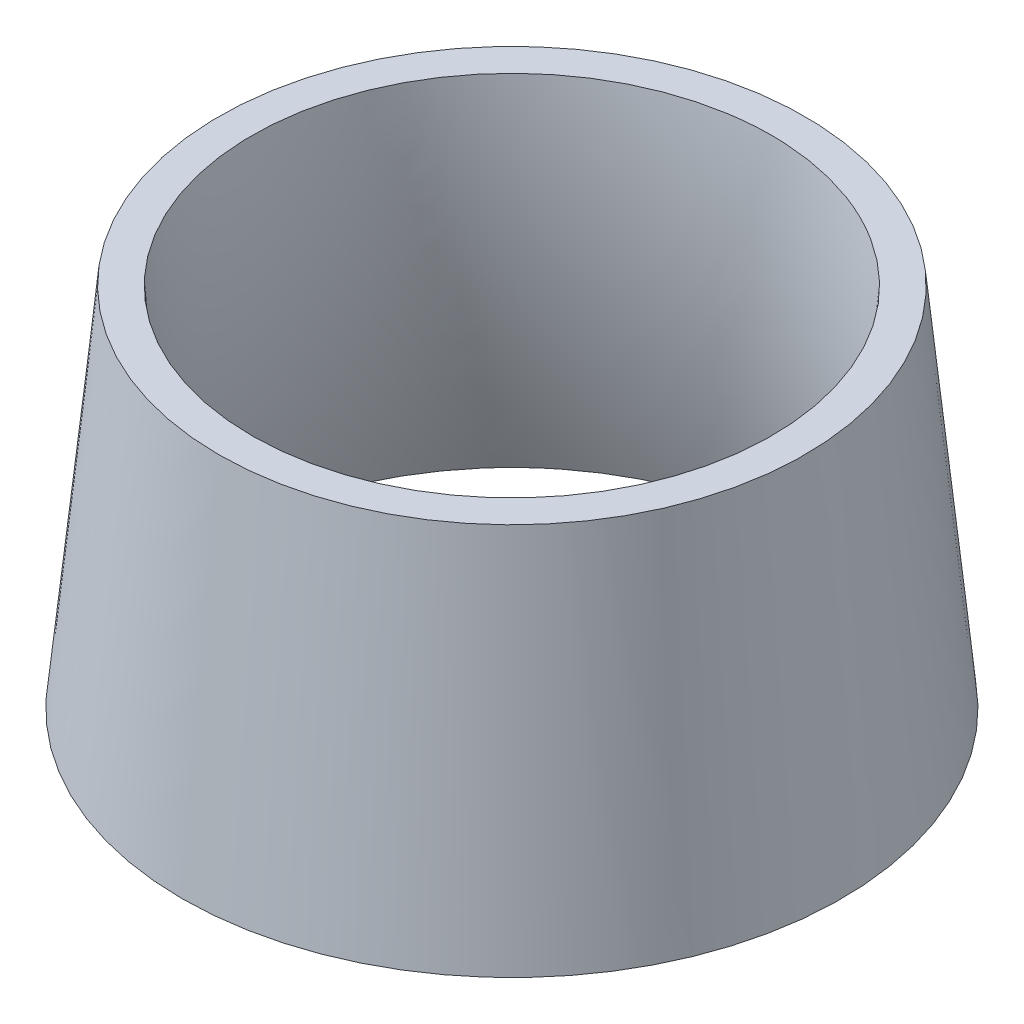
ISO-10303-21;
HEADER;
FILE_DESCRIPTION(('STEP AP214'),'2;1');
FILE_NAME('part.step','',(''),(''),'','','');
FILE_SCHEMA(('AUTOMOTIVE_DESIGN { 1 0 10303 214 1 1 1 1 }'));
ENDSEC;
DATA;
#1=APPLICATION_CONTEXT('core data for automotive mechanical design processes');
#2=APPLICATION_PROTOCOL_DEFINITION('international standard','automotive_design',2000,#1);
#3=PRODUCT_CONTEXT('',#1,'mechanical');
#4=PRODUCT('Part','Part','',(#3));
#5=PRODUCT_RELATED_PRODUCT_CATEGORY('part','',(#4));
#6=PRODUCT_DEFINITION_FORMATION('','',#4);
#7=PRODUCT_DEFINITION_CONTEXT('part definition',#1,'design');
#8=PRODUCT_DEFINITION('design','',#6,#7);
#9=PRODUCT_DEFINITION_SHAPE('','',#8);
#10=(LENGTH_UNIT() NAMED_UNIT(*) SI_UNIT(.MILLI.,.METRE.));
#11=(NAMED_UNIT(*) PLANE_ANGLE_UNIT() SI_UNIT($,.RADIAN.));
#12=(NAMED_UNIT(*) SI_UNIT($,.STERADIAN.) SOLID_ANGLE_UNIT());
#13=UNCERTAINTY_MEASURE_WITH_UNIT(LENGTH_MEASURE(1.E-05),#10,'distance_accuracy_value','');
#14=(GEOMETRIC_REPRESENTATION_CONTEXT(3) GLOBAL_UNCERTAINTY_ASSIGNED_CONTEXT((#13)) GLOBAL_UNIT_ASSIGNED_CONTEXT((#10,
#11,#12)) REPRESENTATION_CONTEXT('',''));
#15=CARTESIAN_POINT('',(0.,0.,0.));
#16=DIRECTION('',(0.,0.,1.));
#17=DIRECTION('',(1.,0.,0.));
#18=AXIS2_PLACEMENT_3D('',#15,#16,#17);
#19=CARTESIAN_POINT('',(0.,0.,0.));
#20=DIRECTION('',(0.,1.,0.));
#21=DIRECTION('',(0.,0.,1.));
#22=AXIS2_PLACEMENT_3D('',#19,#20,#21);
#23=PLANE('',#22);
#24=CARTESIAN_POINT('',(0.,0.,0.));
#25=DIRECTION('',(0.,1.,0.));
#26=DIRECTION('',(0.,0.,1.));
#27=AXIS2_PLACEMENT_3D('',#24,#25,#26);
#28=CIRCLE('',#27,51.181);
#29=CARTESIAN_POINT('',(25.4697236109677,0.,44.3935574175005));
#30=VERTEX_POINT('',#29);
#31=EDGE_CURVE('E48',#30,#30,#28,.T.);
#32=ORIENTED_EDGE('',*,*,#31,.T.);
#33=EDGE_LOOP('',(#32));
#34=FACE_BOUND('',#33,.T.);
#35=CARTESIAN_POINT('',(0.,0.,0.));
#36=DIRECTION('',(0.,1.,0.));
#37=DIRECTION('',(0.,0.,1.));
#38=AXIS2_PLACEMENT_3D('',#35,#36,#37);
#39=CIRCLE('',#38,57.15);
#40=CARTESIAN_POINT('',(0.,0.,57.15));
#41=VERTEX_POINT('',#40);
#42=EDGE_CURVE('E11',#41,#41,#39,.T.);
#43=ORIENTED_EDGE('',*,*,#42,.F.);
#44=EDGE_LOOP('',(#43));
#45=FACE_BOUND('',#44,.T.);
#46=ADVANCED_FACE('F35',(#34,#45),#23,.F.);
#47=CARTESIAN_POINT('',(0.,63.5,0.));
#48=DIRECTION('',(0.,1.,0.));
#49=DIRECTION('',(0.,0.,1.));
#50=AXIS2_PLACEMENT_3D('',#47,#48,#49);
#51=PLANE('',#50);
#52=CARTESIAN_POINT('',(0.,63.5,0.));
#53=DIRECTION('',(0.,1.,0.));
#54=DIRECTION('',(0.,0.,1.));
#55=AXIS2_PLACEMENT_3D('',#52,#53,#54);
#56=CIRCLE('',#55,45.085);
#57=CARTESIAN_POINT('',(-9.05943150786797,63.5,44.1654154939614));
#58=VERTEX_POINT('',#57);
#59=EDGE_CURVE('E106',#58,#58,#56,.T.);
#60=ORIENTED_EDGE('',*,*,#59,.F.);
#61=EDGE_LOOP('',(#60));
#62=FACE_BOUND('',#61,.T.);
#63=CARTESIAN_POINT('',(0.,63.5,0.));
#64=DIRECTION('',(0.,1.,0.));
#65=DIRECTION('',(0.,0.,1.));
#66=AXIS2_PLACEMENT_3D('',#63,#64,#65);
#67=CIRCLE('',#66,50.8);
#68=CARTESIAN_POINT('',(0.,63.5,50.8));
#69=VERTEX_POINT('',#68);
#70=EDGE_CURVE('E43',#69,#69,#67,.T.);
#71=ORIENTED_EDGE('',*,*,#70,.T.);
#72=EDGE_LOOP('',(#71));
#73=FACE_BOUND('',#72,.T.);
#74=ADVANCED_FACE('F68',(#62,#73),#51,.T.);
#75=CARTESIAN_POINT('',(0.,63.5,0.));
#76=DIRECTION('',(0.,-1.,0.));
#77=DIRECTION('',(0.,0.,-1.));
#78=AXIS2_PLACEMENT_3D('',#75,#76,#77);
#79=CONICAL_SURFACE('',#78,50.8,0.0996686524911622);
#80=ORIENTED_EDGE('',*,*,#70,.F.);
#81=EDGE_LOOP('',(#80));
#82=FACE_BOUND('',#81,.T.);
#83=ORIENTED_EDGE('',*,*,#42,.T.);
#84=EDGE_LOOP('',(#83));
#85=FACE_BOUND('',#84,.T.);
#86=ADVANCED_FACE('F77',(#82,#85),#79,.T.);
#87=CARTESIAN_POINT('',(-9.05943150786797,63.5,44.1654154939614));
#88=CARTESIAN_POINT('',(25.4697236109677,0.,44.3935574175005));
#89=CARTESIAN_POINT('',(-97.3902624957908,63.5,26.0465524782255));
#90=CARTESIAN_POINT('',(-63.3173912240335,0.,95.3330046394359));
#91=CARTESIAN_POINT('',(-79.2713994800549,63.5,-62.2842785096974));
#92=CARTESIAN_POINT('',(-114.256838445969,0.,6.54588980443472));
#93=CARTESIAN_POINT('',(9.05943150786796,63.5,-44.1654154939614));
#94=CARTESIAN_POINT('',(-25.4697236109676,0.,-44.3935574175006));
#95=CARTESIAN_POINT('',(97.3902624957908,63.5,-26.0465524782255));
#96=CARTESIAN_POINT('',(63.3173912240335,0.,-95.3330046394358));
#97=CARTESIAN_POINT('',(79.2713994800549,63.5,62.2842785096974));
#98=CARTESIAN_POINT('',(114.256838445969,0.,-6.54588980443471));
#99=CARTESIAN_POINT('',(-9.05943150786797,63.5,44.1654154939614));
#100=CARTESIAN_POINT('',(25.4697236109677,0.,44.3935574175005));
#101=(BOUNDED_SURFACE() B_SPLINE_SURFACE(3,1,((#87,#88),(#89,#90),(#91,#92),(#93,#94),(#95,#96),
(#97,#98),(#99,#100)),.UNSPECIFIED.,.T.,.F.,.F.) B_SPLINE_SURFACE_WITH_KNOTS((4,3,4),(2,2),(0.,
0.5,1.),(0.,1.),.UNSPECIFIED.) GEOMETRIC_REPRESENTATION_ITEM() RATIONAL_B_SPLINE_SURFACE(((1.,
1.),(0.333333333333333,0.333333333333333),(0.333333333333333,0.333333333333333),(1.,1.),
(0.333333333333333,0.333333333333333),(0.333333333333333,0.333333333333333),(1.,1.))) REPRESENTATION_ITEM('') SURFACE());
#102=CARTESIAN_POINT('',(-9.05943150786797,63.5,44.1654154939614));
#103=CARTESIAN_POINT('',(-8.69975280871343,62.8385416666667,44.1677919723316));
#104=CARTESIAN_POINT('',(-8.34007410955889,62.1770833333333,44.1701684507018));
#105=CARTESIAN_POINT('',(-7.62071671124981,60.8541666666667,44.1749214074422));
#106=CARTESIAN_POINT('',(-7.26103801209528,60.1927083333333,44.1772978858124));
#107=CARTESIAN_POINT('',(-6.5416806137862,58.8697916666667,44.1820508425528));
#108=CARTESIAN_POINT('',(-6.18200191463167,58.2083333333333,44.184427320923));
#109=CARTESIAN_POINT('',(-5.46264451632259,56.8854166666667,44.1891802776634));
#110=CARTESIAN_POINT('',(-5.10296581716805,56.2239583333333,44.1915567560336));
#111=CARTESIAN_POINT('',(-4.38360841885898,54.9010416666667,44.196309712774));
#112=CARTESIAN_POINT('',(-4.02392971970444,54.2395833333333,44.1986861911442));
#113=CARTESIAN_POINT('',(-3.30457232139536,52.9166666666667,44.2034391478846));
#114=CARTESIAN_POINT('',(-2.94489362224083,52.2552083333333,44.2058156262548));
#115=CARTESIAN_POINT('',(-2.22553622393175,50.9322916666667,44.2105685829952));
#116=CARTESIAN_POINT('',(-1.86585752477721,50.2708333333333,44.2129450613654));
#117=CARTESIAN_POINT('',(-1.14650012646814,48.9479166666667,44.2176980181058));
#118=CARTESIAN_POINT('',(-0.7868214273136,48.2864583333333,44.220074496476));
#119=CARTESIAN_POINT('',(-0.0674640290045235,46.9635416666667,44.2248274532164));
#120=CARTESIAN_POINT('',(0.292214670150015,46.3020833333333,44.2272039315866));
#121=CARTESIAN_POINT('',(1.01157206845909,44.9791666666667,44.231956888327));
#122=CARTESIAN_POINT('',(1.37125076761363,44.3177083333333,44.2343333666972));
#123=CARTESIAN_POINT('',(2.0906081659227,42.9947916666667,44.2390863234376));
#124=CARTESIAN_POINT('',(2.45028686507724,42.3333333333333,44.2414628018078));
#125=CARTESIAN_POINT('',(3.16964426338631,41.0104166666667,44.2462157585482));
#126=CARTESIAN_POINT('',(3.52932296254085,40.3489583333333,44.2485922369184));
#127=CARTESIAN_POINT('',(4.24868036084993,39.0260416666667,44.2533451936588));
#128=CARTESIAN_POINT('',(4.60835906000447,38.3645833333333,44.255721672029));
#129=CARTESIAN_POINT('',(5.32771645831354,37.0416666666667,44.2604746287694));
#130=CARTESIAN_POINT('',(5.68739515746808,36.3802083333333,44.2628511071396));
#131=CARTESIAN_POINT('',(6.40675255577715,35.0572916666667,44.26760406388));
#132=CARTESIAN_POINT('',(6.76643125493169,34.3958333333333,44.2699805422502));
#133=CARTESIAN_POINT('',(7.48578865324077,33.0729166666667,44.2747334989906));
#134=CARTESIAN_POINT('',(7.8454673523953,32.4114583333333,44.2771099773608));
#135=CARTESIAN_POINT('',(8.56482475070438,31.0885416666667,44.2818629341012));
#136=CARTESIAN_POINT('',(8.92450344985892,30.4270833333333,44.2842394124714));
#137=CARTESIAN_POINT('',(9.64386084816799,29.1041666666667,44.2889923692118));
#138=CARTESIAN_POINT('',(10.0035395473225,28.4427083333333,44.291368847582));
#139=CARTESIAN_POINT('',(10.7228969456316,27.1197916666667,44.2961218043224));
#140=CARTESIAN_POINT('',(11.0825756447861,26.4583333333333,44.2984982826926));
#141=CARTESIAN_POINT('',(11.8019330430952,25.1354166666667,44.303251239433));
#142=CARTESIAN_POINT('',(12.1616117422498,24.4739583333333,44.3056277178032));
#143=CARTESIAN_POINT('',(12.8809691405588,23.1510416666667,44.3103806745436));
#144=CARTESIAN_POINT('',(13.2406478397134,22.4895833333333,44.3127571529138));
#145=CARTESIAN_POINT('',(13.9600052380224,21.1666666666667,44.3175101096542));
#146=CARTESIAN_POINT('',(14.319683937177,20.5052083333333,44.3198865880244));
#147=CARTESIAN_POINT('',(15.0390413354861,19.1822916666667,44.3246395447648));
#148=CARTESIAN_POINT('',(15.3987200346406,18.5208333333333,44.327016023135));
#149=CARTESIAN_POINT('',(16.1180774329497,17.1979166666667,44.3317689798754));
#150=CARTESIAN_POINT('',(16.4777561321042,16.5364583333333,44.3341454582456));
#151=CARTESIAN_POINT('',(17.1971135304133,15.2135416666667,44.338898414986));
#152=CARTESIAN_POINT('',(17.5567922295678,14.5520833333333,44.3412748933562));
#153=CARTESIAN_POINT('',(18.2761496278769,13.2291666666667,44.3460278500966));
#154=CARTESIAN_POINT('',(18.6358283270314,12.5677083333333,44.3484043284668));
#155=CARTESIAN_POINT('',(19.3551857253405,11.2447916666667,44.3531572852072));
#156=CARTESIAN_POINT('',(19.7148644244951,10.5833333333333,44.3555337635774));
#157=CARTESIAN_POINT('',(20.4342218228041,9.26041666666667,44.3602867203177));
#158=CARTESIAN_POINT('',(20.7939005219587,8.59895833333333,44.362663198688));
#159=CARTESIAN_POINT('',(21.5132579202677,7.27604166666667,44.3674161554283));
#160=CARTESIAN_POINT('',(21.8729366194223,6.61458333333333,44.3697926337985));
#161=CARTESIAN_POINT('',(22.5922940177314,5.29166666666667,44.374545590539));
#162=CARTESIAN_POINT('',(22.9519727168859,4.63020833333333,44.3769220689092));
#163=CARTESIAN_POINT('',(23.671330115195,3.30729166666667,44.3816750256495));
#164=CARTESIAN_POINT('',(24.0310088143495,2.64583333333333,44.3840515040198));
#165=CARTESIAN_POINT('',(24.7503662126586,1.32291666666667,44.3888044607601));
#166=CARTESIAN_POINT('',(25.1100449118131,0.661458333333334,44.3911809391303));
#167=CARTESIAN_POINT('',(25.4697236109677,0.,44.3935574175005));
#168=B_SPLINE_CURVE_WITH_KNOTS('',3,(#102,#103,#104,#105,#106,#107,#108,#109,#110,#111,#112,
#113,#114,#115,#116,#117,#118,#119,#120,#121,#122,#123,#124,#125,#126,#127,#128,#129,#130,#131,
#132,#133,#134,#135,#136,#137,#138,#139,#140,#141,#142,#143,#144,#145,#146,#147,#148,#149,#150,
#151,#152,#153,#154,#155,#156,#157,#158,#159,#160,#161,#162,#163,#164,#165,#166,#167),
.UNSPECIFIED.,.F.,.F.,(4,2,2,2,2,2,2,2,2,2,2,2,2,2,2,2,2,2,2,2,2,2,2,2,2,2,2,2,2,2,2,2,4),(0.,
2.25878592812588,4.51757185625176,6.77635778437765,9.03514371250353,11.2939296406294,
13.5527155687553,15.8115014968812,18.0702874250071,20.3290733531329,22.5878592812588,
24.8466452093847,27.1054311375106,29.3642170656365,31.6230029937623,33.8817889218882,
36.1405748500141,38.39936077814,40.6581467062659,42.9169326343917,45.1757185625176,
47.4345044906435,49.6932904187694,51.9520763468953,54.2108622750211,56.469648203147,
58.7284341312729,60.9872200593988,63.2460059875247,65.5047919156505,67.7635778437764,
70.0223637719023,72.2811497000282),.UNSPECIFIED.);
#169=EDGE_CURVE('BSEAM79',#58,#30,#168,.T.);
#170=ORIENTED_EDGE('',*,*,#59,.T.);
#171=ORIENTED_EDGE('',*,*,#31,.F.);
#172=ORIENTED_EDGE('',*,*,#169,.T.);
#173=ORIENTED_EDGE('',*,*,#169,.F.);
#174=EDGE_LOOP('',(#170,#172,#171,#173));
#175=FACE_BOUND('',#174,.T.);
#176=ADVANCED_FACE('F79',(#175),#101,.F.);
#177=CLOSED_SHELL('',(#46,#74,#86,#176));
#178=MANIFOLD_SOLID_BREP('B2',#177);
#179=ADVANCED_BREP_SHAPE_REPRESENTATION('',(#18,#178),#14);
#180=SHAPE_DEFINITION_REPRESENTATION(#9,#179);
ENDSEC;
END-ISO-10303-21;
